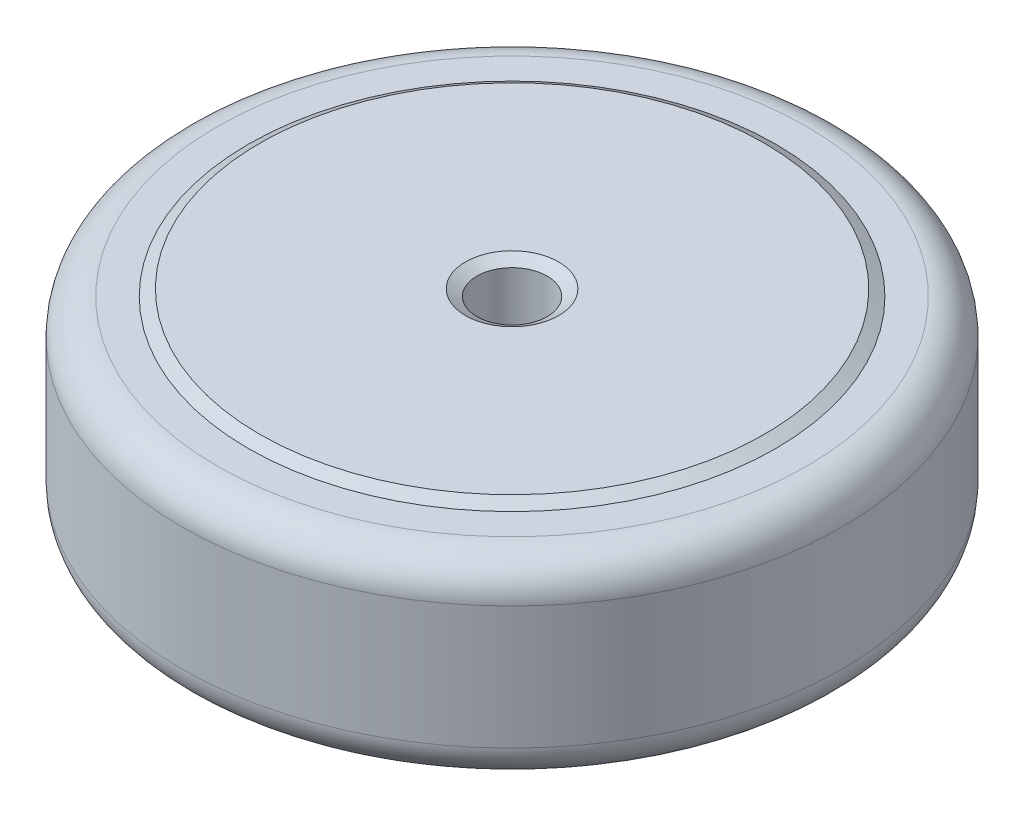
ISO-10303-21;
HEADER;
FILE_DESCRIPTION(('STEP AP214'),'2;1');
FILE_NAME('part.step','',(''),(''),'','','');
FILE_SCHEMA(('AUTOMOTIVE_DESIGN { 1 0 10303 214 1 1 1 1 }'));
ENDSEC;
DATA;
#1=APPLICATION_CONTEXT('core data for automotive mechanical design processes');
#2=APPLICATION_PROTOCOL_DEFINITION('international standard','automotive_design',2000,#1);
#3=PRODUCT_CONTEXT('',#1,'mechanical');
#4=PRODUCT('Part','Part','',(#3));
#5=PRODUCT_RELATED_PRODUCT_CATEGORY('part','',(#4));
#6=PRODUCT_DEFINITION_FORMATION('','',#4);
#7=PRODUCT_DEFINITION_CONTEXT('part definition',#1,'design');
#8=PRODUCT_DEFINITION('design','',#6,#7);
#9=PRODUCT_DEFINITION_SHAPE('','',#8);
#10=(LENGTH_UNIT() NAMED_UNIT(*) SI_UNIT(.MILLI.,.METRE.));
#11=(NAMED_UNIT(*) PLANE_ANGLE_UNIT() SI_UNIT($,.RADIAN.));
#12=(NAMED_UNIT(*) SI_UNIT($,.STERADIAN.) SOLID_ANGLE_UNIT());
#13=UNCERTAINTY_MEASURE_WITH_UNIT(LENGTH_MEASURE(1.E-05),#10,'distance_accuracy_value','');
#14=(GEOMETRIC_REPRESENTATION_CONTEXT(3) GLOBAL_UNCERTAINTY_ASSIGNED_CONTEXT((#13)) GLOBAL_UNIT_ASSIGNED_CONTEXT((#10,
#11,#12)) REPRESENTATION_CONTEXT('',''));
#15=CARTESIAN_POINT('',(0.,0.,0.));
#16=DIRECTION('',(0.,0.,1.));
#17=DIRECTION('',(1.,0.,0.));
#18=AXIS2_PLACEMENT_3D('',#15,#16,#17);
#19=CARTESIAN_POINT('',(0.,0.,0.));
#20=DIRECTION('',(0.,1.,0.));
#21=DIRECTION('',(0.,0.,1.));
#22=AXIS2_PLACEMENT_3D('',#19,#20,#21);
#23=CYLINDRICAL_SURFACE('',#22,4.);
#24=CARTESIAN_POINT('',(0.,11.0000000000241,0.));
#25=DIRECTION('',(0.,1.,0.));
#26=DIRECTION('',(-1.,0.,0.));
#27=AXIS2_PLACEMENT_3D('',#24,#25,#26);
#28=CIRCLE('',#27,3.99999999990541);
#29=CARTESIAN_POINT('',(-3.99999999990541,11.0000000000241,0.));
#30=VERTEX_POINT('',#29);
#31=EDGE_CURVE('E142',#30,#30,#28,.T.);
#32=ORIENTED_EDGE('',*,*,#31,.T.);
#33=EDGE_LOOP('',(#32));
#34=FACE_BOUND('',#33,.T.);
#35=CARTESIAN_POINT('',(0.,-11.,0.));
#36=DIRECTION('',(0.,-1.,0.));
#37=DIRECTION('',(0.,0.,-1.));
#38=AXIS2_PLACEMENT_3D('',#35,#36,#37);
#39=CIRCLE('',#38,4.);
#40=CARTESIAN_POINT('',(0.,-11.,-4.));
#41=VERTEX_POINT('',#40);
#42=EDGE_CURVE('E138',#41,#41,#39,.T.);
#43=ORIENTED_EDGE('',*,*,#42,.T.);
#44=EDGE_LOOP('',(#43));
#45=FACE_BOUND('',#44,.T.);
#46=ADVANCED_FACE('F14',(#34,#45),#23,.F.);
#47=CARTESIAN_POINT('',(0.,11.7500000015411,0.));
#48=DIRECTION('',(0.,1.,0.));
#49=DIRECTION('',(0.,0.,1.));
#50=AXIS2_PLACEMENT_3D('',#47,#48,#49);
#51=CONICAL_SURFACE('',#50,5.29903810468113,1.04719755000655);
#52=ORIENTED_EDGE('',*,*,#31,.F.);
#53=EDGE_LOOP('',(#52));
#54=FACE_BOUND('',#53,.T.);
#55=CARTESIAN_POINT('',(0.,11.7500000016068,0.));
#56=DIRECTION('',(0.,1.,0.));
#57=DIRECTION('',(0.,0.,1.));
#58=AXIS2_PLACEMENT_3D('',#55,#56,#57);
#59=CIRCLE('',#58,5.29903810479482);
#60=CARTESIAN_POINT('',(0.,11.7500000016068,5.29903810479482));
#61=VERTEX_POINT('',#60);
#62=EDGE_CURVE('E18',#61,#61,#59,.T.);
#63=ORIENTED_EDGE('',*,*,#62,.T.);
#64=EDGE_LOOP('',(#63));
#65=FACE_BOUND('',#64,.T.);
#66=ADVANCED_FACE('F93',(#54,#65),#51,.F.);
#67=CARTESIAN_POINT('',(0.,-11.,0.));
#68=DIRECTION('',(0.,-1.,0.));
#69=DIRECTION('',(0.,0.,-1.));
#70=AXIS2_PLACEMENT_3D('',#67,#68,#69);
#71=CONICAL_SURFACE('',#70,4.,1.0471975511966);
#72=ORIENTED_EDGE('',*,*,#42,.F.);
#73=EDGE_LOOP('',(#72));
#74=FACE_BOUND('',#73,.T.);
#75=CARTESIAN_POINT('',(0.,-11.75,0.));
#76=DIRECTION('',(0.,-1.,0.));
#77=DIRECTION('',(0.,0.,-1.));
#78=AXIS2_PLACEMENT_3D('',#75,#76,#77);
#79=CIRCLE('',#78,5.29903810567666);
#80=CARTESIAN_POINT('',(0.,-11.75,-5.29903810567666));
#81=VERTEX_POINT('',#80);
#82=EDGE_CURVE('E134',#81,#81,#79,.T.);
#83=ORIENTED_EDGE('',*,*,#82,.T.);
#84=EDGE_LOOP('',(#83));
#85=FACE_BOUND('',#84,.T.);
#86=ADVANCED_FACE('F91',(#74,#85),#71,.F.);
#87=CARTESIAN_POINT('',(0.,11.75,0.));
#88=DIRECTION('',(0.,-1.,0.));
#89=DIRECTION('',(0.,0.,-1.));
#90=AXIS2_PLACEMENT_3D('',#87,#88,#89);
#91=PLANE('',#90);
#92=ORIENTED_EDGE('',*,*,#62,.F.);
#93=EDGE_LOOP('',(#92));
#94=FACE_BOUND('',#93,.T.);
#95=CARTESIAN_POINT('',(0.,11.7500000015544,0.));
#96=DIRECTION('',(0.,-1.,0.));
#97=DIRECTION('',(0.,0.,-1.));
#98=AXIS2_PLACEMENT_3D('',#95,#96,#97);
#99=CIRCLE('',#98,28.7009618952208);
#100=CARTESIAN_POINT('',(0.,11.7500000015544,-28.7009618952208));
#101=VERTEX_POINT('',#100);
#102=EDGE_CURVE('E132',#101,#101,#99,.T.);
#103=ORIENTED_EDGE('',*,*,#102,.F.);
#104=EDGE_LOOP('',(#103));
#105=FACE_BOUND('',#104,.T.);
#106=ADVANCED_FACE('F88',(#94,#105),#91,.F.);
#107=CARTESIAN_POINT('',(29.2749811322098,-11.75,29.2749811322098));
#108=DIRECTION('',(0.,1.,0.));
#109=DIRECTION('',(0.,0.,-1.));
#110=AXIS2_PLACEMENT_3D('',#107,#108,#109);
#111=PLANE('',#110);
#112=ORIENTED_EDGE('',*,*,#82,.F.);
#113=EDGE_LOOP('',(#112));
#114=FACE_BOUND('',#113,.T.);
#115=CARTESIAN_POINT('',(0.,-11.75,0.));
#116=DIRECTION('',(0.,1.,0.));
#117=DIRECTION('',(0.,0.,1.));
#118=AXIS2_PLACEMENT_3D('',#115,#116,#117);
#119=CIRCLE('',#118,28.7009618943233);
#120=CARTESIAN_POINT('',(0.,-11.75,28.7009618943234));
#121=VERTEX_POINT('',#120);
#122=EDGE_CURVE('E124',#121,#121,#119,.T.);
#123=ORIENTED_EDGE('',*,*,#122,.F.);
#124=EDGE_LOOP('',(#123));
#125=FACE_BOUND('',#124,.T.);
#126=ADVANCED_FACE('F86',(#114,#125),#111,.F.);
#127=CARTESIAN_POINT('',(0.,11.,0.));
#128=DIRECTION('',(0.,-1.,0.));
#129=DIRECTION('',(0.,0.,-1.));
#130=AXIS2_PLACEMENT_3D('',#127,#128,#129);
#131=CONICAL_SURFACE('',#130,30.,1.04719755);
#132=CARTESIAN_POINT('',(0.,11.,0.));
#133=DIRECTION('',(0.,-1.,0.));
#134=DIRECTION('',(0.,0.,-1.));
#135=AXIS2_PLACEMENT_3D('',#132,#133,#134);
#136=CIRCLE('',#135,30.);
#137=CARTESIAN_POINT('',(0.,11.,-30.));
#138=VERTEX_POINT('',#137);
#139=EDGE_CURVE('E119',#138,#138,#136,.F.);
#140=ORIENTED_EDGE('',*,*,#139,.T.);
#141=EDGE_LOOP('',(#140));
#142=FACE_BOUND('',#141,.T.);
#143=ORIENTED_EDGE('',*,*,#102,.T.);
#144=EDGE_LOOP('',(#143));
#145=FACE_BOUND('',#144,.T.);
#146=ADVANCED_FACE('F83',(#142,#145),#131,.T.);
#147=CARTESIAN_POINT('',(0.,-11.,0.));
#148=DIRECTION('',(0.,1.,0.));
#149=DIRECTION('',(0.,0.,1.));
#150=AXIS2_PLACEMENT_3D('',#147,#148,#149);
#151=CONICAL_SURFACE('',#150,30.,1.0471975511966);
#152=CARTESIAN_POINT('',(0.,-11.,0.));
#153=DIRECTION('',(0.,1.,0.));
#154=DIRECTION('',(0.,0.,1.));
#155=AXIS2_PLACEMENT_3D('',#152,#153,#154);
#156=CIRCLE('',#155,30.);
#157=CARTESIAN_POINT('',(0.,-11.,30.));
#158=VERTEX_POINT('',#157);
#159=EDGE_CURVE('E117',#158,#158,#156,.T.);
#160=ORIENTED_EDGE('',*,*,#159,.F.);
#161=EDGE_LOOP('',(#160));
#162=FACE_BOUND('',#161,.T.);
#163=ORIENTED_EDGE('',*,*,#122,.T.);
#164=EDGE_LOOP('',(#163));
#165=FACE_BOUND('',#164,.T.);
#166=ADVANCED_FACE('F16',(#162,#165),#151,.T.);
#167=CARTESIAN_POINT('',(0.,11.,0.));
#168=DIRECTION('',(0.,-1.,0.));
#169=DIRECTION('',(0.,0.,-1.));
#170=AXIS2_PLACEMENT_3D('',#167,#168,#169);
#171=PLANE('',#170);
#172=ORIENTED_EDGE('',*,*,#139,.F.);
#173=EDGE_LOOP('',(#172));
#174=FACE_BOUND('',#173,.T.);
#175=CARTESIAN_POINT('',(0.,11.,0.));
#176=DIRECTION('',(0.,-1.,0.));
#177=DIRECTION('',(-1.,0.,0.));
#178=AXIS2_PLACEMENT_3D('',#175,#176,#177);
#179=CIRCLE('',#178,33.5);
#180=CARTESIAN_POINT('',(-33.5,11.,0.));
#181=VERTEX_POINT('',#180);
#182=EDGE_CURVE('E65',#181,#181,#179,.T.);
#183=ORIENTED_EDGE('',*,*,#182,.F.);
#184=EDGE_LOOP('',(#183));
#185=FACE_BOUND('',#184,.T.);
#186=ADVANCED_FACE('F71',(#174,#185),#171,.F.);
#187=CARTESIAN_POINT('',(0.,-11.,0.));
#188=DIRECTION('',(0.,-1.,0.));
#189=DIRECTION('',(0.,0.,-1.));
#190=AXIS2_PLACEMENT_3D('',#187,#188,#189);
#191=PLANE('',#190);
#192=ORIENTED_EDGE('',*,*,#159,.T.);
#193=EDGE_LOOP('',(#192));
#194=FACE_BOUND('',#193,.T.);
#195=CARTESIAN_POINT('',(0.,-11.,0.));
#196=DIRECTION('',(0.,1.,0.));
#197=DIRECTION('',(-1.,0.,0.));
#198=AXIS2_PLACEMENT_3D('',#195,#196,#197);
#199=CIRCLE('',#198,33.5);
#200=CARTESIAN_POINT('',(-33.5,-11.,0.));
#201=VERTEX_POINT('',#200);
#202=EDGE_CURVE('E27',#201,#201,#199,.T.);
#203=ORIENTED_EDGE('',*,*,#202,.F.);
#204=EDGE_LOOP('',(#203));
#205=FACE_BOUND('',#204,.T.);
#206=ADVANCED_FACE('F80',(#194,#205),#191,.T.);
#207=CARTESIAN_POINT('',(0.,7.,0.));
#208=DIRECTION('',(0.,-1.,0.));
#209=DIRECTION('',(0.,0.,-1.));
#210=AXIS2_PLACEMENT_3D('',#207,#208,#209);
#211=TOROIDAL_SURFACE('',#210,33.5,4.);
#212=CARTESIAN_POINT('',(0.,7.,0.));
#213=DIRECTION('',(0.,1.,0.));
#214=DIRECTION('',(0.,0.,1.));
#215=AXIS2_PLACEMENT_3D('',#212,#213,#214);
#216=CIRCLE('',#215,37.5);
#217=CARTESIAN_POINT('',(0.,7.,37.5));
#218=VERTEX_POINT('',#217);
#219=EDGE_CURVE('E22',#218,#218,#216,.F.);
#220=ORIENTED_EDGE('',*,*,#219,.F.);
#221=EDGE_LOOP('',(#220));
#222=FACE_BOUND('',#221,.T.);
#223=ORIENTED_EDGE('',*,*,#182,.T.);
#224=EDGE_LOOP('',(#223));
#225=FACE_BOUND('',#224,.T.);
#226=ADVANCED_FACE('F45',(#222,#225),#211,.T.);
#227=CARTESIAN_POINT('',(0.,-7.,0.));
#228=DIRECTION('',(0.,1.,0.));
#229=DIRECTION('',(0.,0.,1.));
#230=AXIS2_PLACEMENT_3D('',#227,#228,#229);
#231=TOROIDAL_SURFACE('',#230,33.5,4.);
#232=CARTESIAN_POINT('',(0.,-7.,0.));
#233=DIRECTION('',(0.,1.,0.));
#234=DIRECTION('',(0.,0.,1.));
#235=AXIS2_PLACEMENT_3D('',#232,#233,#234);
#236=CIRCLE('',#235,37.5);
#237=CARTESIAN_POINT('',(0.,-7.,37.5));
#238=VERTEX_POINT('',#237);
#239=EDGE_CURVE('E10',#238,#238,#236,.T.);
#240=ORIENTED_EDGE('',*,*,#239,.F.);
#241=EDGE_LOOP('',(#240));
#242=FACE_BOUND('',#241,.T.);
#243=ORIENTED_EDGE('',*,*,#202,.T.);
#244=EDGE_LOOP('',(#243));
#245=FACE_BOUND('',#244,.T.);
#246=ADVANCED_FACE('F39',(#242,#245),#231,.T.);
#247=CARTESIAN_POINT('',(0.,0.,0.));
#248=DIRECTION('',(0.,1.,0.));
#249=DIRECTION('',(0.,0.,1.));
#250=AXIS2_PLACEMENT_3D('',#247,#248,#249);
#251=CYLINDRICAL_SURFACE('',#250,37.5);
#252=ORIENTED_EDGE('',*,*,#239,.T.);
#253=EDGE_LOOP('',(#252));
#254=FACE_BOUND('',#253,.T.);
#255=ORIENTED_EDGE('',*,*,#219,.T.);
#256=EDGE_LOOP('',(#255));
#257=FACE_BOUND('',#256,.T.);
#258=ADVANCED_FACE('F44',(#254,#257),#251,.T.);
#259=CLOSED_SHELL('',(#46,#66,#86,#106,#126,#146,#166,#186,#206,#226,#246,#258));
#260=MANIFOLD_SOLID_BREP('B1',#259);
#261=ADVANCED_BREP_SHAPE_REPRESENTATION('',(#18,#260),#14);
#262=SHAPE_DEFINITION_REPRESENTATION(#9,#261);
ENDSEC;
END-ISO-10303-21;
